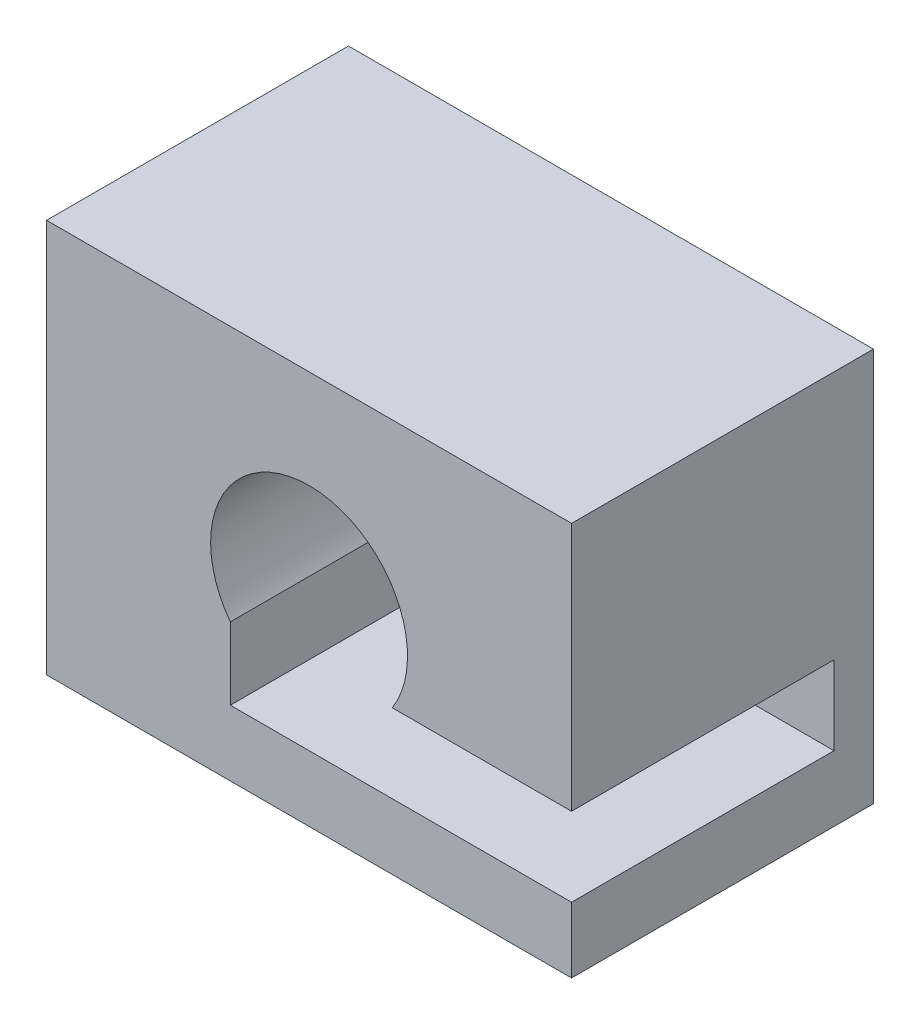
ISO-10303-21;
HEADER;
FILE_DESCRIPTION(('STEP AP214'),'2;1');
FILE_NAME('part.step','',(''),(''),'','','');
FILE_SCHEMA(('AUTOMOTIVE_DESIGN { 1 0 10303 214 1 1 1 1 }'));
ENDSEC;
DATA;
#1=APPLICATION_CONTEXT('core data for automotive mechanical design processes');
#2=APPLICATION_PROTOCOL_DEFINITION('international standard','automotive_design',2000,#1);
#3=PRODUCT_CONTEXT('',#1,'mechanical');
#4=PRODUCT('Part','Part','',(#3));
#5=PRODUCT_RELATED_PRODUCT_CATEGORY('part','',(#4));
#6=PRODUCT_DEFINITION_FORMATION('','',#4);
#7=PRODUCT_DEFINITION_CONTEXT('part definition',#1,'design');
#8=PRODUCT_DEFINITION('design','',#6,#7);
#9=PRODUCT_DEFINITION_SHAPE('','',#8);
#10=(LENGTH_UNIT() NAMED_UNIT(*) SI_UNIT(.MILLI.,.METRE.));
#11=(NAMED_UNIT(*) PLANE_ANGLE_UNIT() SI_UNIT($,.RADIAN.));
#12=(NAMED_UNIT(*) SI_UNIT($,.STERADIAN.) SOLID_ANGLE_UNIT());
#13=UNCERTAINTY_MEASURE_WITH_UNIT(LENGTH_MEASURE(1.E-05),#10,'distance_accuracy_value','');
#14=(GEOMETRIC_REPRESENTATION_CONTEXT(3) GLOBAL_UNCERTAINTY_ASSIGNED_CONTEXT((#13)) GLOBAL_UNIT_ASSIGNED_CONTEXT((#10,
#11,#12)) REPRESENTATION_CONTEXT('',''));
#15=CARTESIAN_POINT('',(0.,0.,0.));
#16=DIRECTION('',(0.,0.,1.));
#17=DIRECTION('',(1.,0.,0.));
#18=AXIS2_PLACEMENT_3D('',#15,#16,#17);
#19=CARTESIAN_POINT('',(20.,15.,23.));
#20=DIRECTION('',(1.,0.,0.));
#21=DIRECTION('',(0.,1.,0.));
#22=AXIS2_PLACEMENT_3D('',#19,#20,#21);
#23=PLANE('',#22);
#24=DIRECTION('',(0.,-1.,0.));
#25=VECTOR('',#24,1.);
#26=CARTESIAN_POINT('',(20.,15.,23.));
#27=LINE('',#26,#25);
#28=CARTESIAN_POINT('',(20.,15.,23.));
#29=VERTEX_POINT('',#28);
#30=CARTESIAN_POINT('',(20.,-4.,23.));
#31=VERTEX_POINT('',#30);
#32=EDGE_CURVE('E168',#29,#31,#27,.T.);
#33=ORIENTED_EDGE('',*,*,#32,.T.);
#34=DIRECTION('',(0.,0.,1.));
#35=VECTOR('',#34,1.);
#36=CARTESIAN_POINT('',(20.,-4.,3.));
#37=LINE('',#36,#35);
#38=CARTESIAN_POINT('',(20.,-4.,3.));
#39=VERTEX_POINT('',#38);
#40=EDGE_CURVE('E154',#39,#31,#37,.T.);
#41=ORIENTED_EDGE('',*,*,#40,.F.);
#42=DIRECTION('',(0.,1.,0.));
#43=VECTOR('',#42,1.);
#44=CARTESIAN_POINT('',(20.,0.,3.));
#45=LINE('',#44,#43);
#46=CARTESIAN_POINT('',(20.,-10.,3.));
#47=VERTEX_POINT('',#46);
#48=EDGE_CURVE('E142',#47,#39,#45,.T.);
#49=ORIENTED_EDGE('',*,*,#48,.F.);
#50=DIRECTION('',(0.,0.,1.));
#51=VECTOR('',#50,1.);
#52=CARTESIAN_POINT('',(20.,-10.,3.));
#53=LINE('',#52,#51);
#54=CARTESIAN_POINT('',(20.,-10.,23.));
#55=VERTEX_POINT('',#54);
#56=EDGE_CURVE('E156',#47,#55,#53,.T.);
#57=ORIENTED_EDGE('',*,*,#56,.T.);
#58=CARTESIAN_POINT('',(20.,-15.,23.));
#59=VERTEX_POINT('',#58);
#60=EDGE_CURVE('E167',#55,#59,#27,.T.);
#61=ORIENTED_EDGE('',*,*,#60,.T.);
#62=DIRECTION('',(0.,0.,-1.));
#63=VECTOR('',#62,1.);
#64=CARTESIAN_POINT('',(20.,-15.,23.));
#65=LINE('',#64,#63);
#66=CARTESIAN_POINT('',(20.,-15.,0.));
#67=VERTEX_POINT('',#66);
#68=EDGE_CURVE('E41',#59,#67,#65,.T.);
#69=ORIENTED_EDGE('',*,*,#68,.T.);
#70=DIRECTION('',(0.,-1.,0.));
#71=VECTOR('',#70,1.);
#72=CARTESIAN_POINT('',(20.,15.,0.));
#73=LINE('',#72,#71);
#74=CARTESIAN_POINT('',(20.,15.,0.));
#75=VERTEX_POINT('',#74);
#76=EDGE_CURVE('E177',#75,#67,#73,.T.);
#77=ORIENTED_EDGE('',*,*,#76,.F.);
#78=DIRECTION('',(0.,0.,-1.));
#79=VECTOR('',#78,1.);
#80=CARTESIAN_POINT('',(20.,15.,23.));
#81=LINE('',#80,#79);
#82=EDGE_CURVE('E183',#29,#75,#81,.T.);
#83=ORIENTED_EDGE('',*,*,#82,.F.);
#84=EDGE_LOOP('',(#33,#41,#49,#57,#61,#69,#77,#83));
#85=FACE_BOUND('',#84,.T.);
#86=ADVANCED_FACE('F33',(#85),#23,.T.);
#87=CARTESIAN_POINT('',(0.,0.,23.));
#88=DIRECTION('',(0.,0.,1.));
#89=DIRECTION('',(1.,0.,0.));
#90=AXIS2_PLACEMENT_3D('',#87,#88,#89);
#91=PLANE('',#90);
#92=CARTESIAN_POINT('',(0.,0.,23.));
#93=DIRECTION('',(0.,0.,1.));
#94=DIRECTION('',(1.,0.,0.));
#95=AXIS2_PLACEMENT_3D('',#92,#93,#94);
#96=CIRCLE('',#95,7.5);
#97=CARTESIAN_POINT('',(6.34428877022476,-4.,23.));
#98=VERTEX_POINT('',#97);
#99=CARTESIAN_POINT('',(-6.,-4.5,23.));
#100=VERTEX_POINT('',#99);
#101=EDGE_CURVE('E48',#98,#100,#96,.T.);
#102=ORIENTED_EDGE('',*,*,#101,.F.);
#103=DIRECTION('',(1.,0.,0.));
#104=VECTOR('',#103,1.);
#105=CARTESIAN_POINT('',(0.,-4.,23.));
#106=LINE('',#105,#104);
#107=EDGE_CURVE('E135',#98,#31,#106,.T.);
#108=ORIENTED_EDGE('',*,*,#107,.T.);
#109=ORIENTED_EDGE('',*,*,#32,.F.);
#110=DIRECTION('',(1.,0.,0.));
#111=VECTOR('',#110,1.);
#112=CARTESIAN_POINT('',(-20.,15.,23.));
#113=LINE('',#112,#111);
#114=CARTESIAN_POINT('',(-20.,15.,23.));
#115=VERTEX_POINT('',#114);
#116=EDGE_CURVE('E171',#115,#29,#113,.T.);
#117=ORIENTED_EDGE('',*,*,#116,.F.);
#118=DIRECTION('',(0.,-1.,0.));
#119=VECTOR('',#118,1.);
#120=CARTESIAN_POINT('',(-20.,15.,23.));
#121=LINE('',#120,#119);
#122=CARTESIAN_POINT('',(-20.,-15.,23.));
#123=VERTEX_POINT('',#122);
#124=EDGE_CURVE('E163',#115,#123,#121,.T.);
#125=ORIENTED_EDGE('',*,*,#124,.T.);
#126=DIRECTION('',(1.,0.,0.));
#127=VECTOR('',#126,1.);
#128=CARTESIAN_POINT('',(-20.,-15.,23.));
#129=LINE('',#128,#127);
#130=EDGE_CURVE('E83',#123,#59,#129,.T.);
#131=ORIENTED_EDGE('',*,*,#130,.T.);
#132=ORIENTED_EDGE('',*,*,#60,.F.);
#133=DIRECTION('',(1.,0.,0.));
#134=VECTOR('',#133,1.);
#135=CARTESIAN_POINT('',(0.,-10.,23.));
#136=LINE('',#135,#134);
#137=CARTESIAN_POINT('',(-6.,-10.,23.));
#138=VERTEX_POINT('',#137);
#139=EDGE_CURVE('E138',#138,#55,#136,.T.);
#140=ORIENTED_EDGE('',*,*,#139,.F.);
#141=DIRECTION('',(0.,-1.,0.));
#142=VECTOR('',#141,1.);
#143=CARTESIAN_POINT('',(-6.,0.,23.));
#144=LINE('',#143,#142);
#145=EDGE_CURVE('E148',#100,#138,#144,.T.);
#146=ORIENTED_EDGE('',*,*,#145,.F.);
#147=EDGE_LOOP('',(#102,#108,#109,#117,#125,#131,#132,#140,#146));
#148=FACE_BOUND('',#147,.T.);
#149=ADVANCED_FACE('F196',(#148),#91,.T.);
#150=CARTESIAN_POINT('',(0.,0.,0.));
#151=DIRECTION('',(0.,0.,1.));
#152=DIRECTION('',(1.,0.,0.));
#153=AXIS2_PLACEMENT_3D('',#150,#151,#152);
#154=CYLINDRICAL_SURFACE('',#153,6.1);
#155=CARTESIAN_POINT('',(0.,0.,0.));
#156=DIRECTION('',(0.,0.,1.));
#157=DIRECTION('',(1.,0.,0.));
#158=AXIS2_PLACEMENT_3D('',#155,#156,#157);
#159=CIRCLE('',#158,6.1);
#160=CARTESIAN_POINT('',(6.1,0.,0.));
#161=VERTEX_POINT('',#160);
#162=EDGE_CURVE('E153',#161,#161,#159,.T.);
#163=ORIENTED_EDGE('',*,*,#162,.F.);
#164=EDGE_LOOP('',(#163));
#165=FACE_BOUND('',#164,.T.);
#166=CARTESIAN_POINT('',(0.,0.,3.));
#167=DIRECTION('',(0.,0.,1.));
#168=DIRECTION('',(1.,0.,0.));
#169=AXIS2_PLACEMENT_3D('',#166,#167,#168);
#170=CIRCLE('',#169,6.1);
#171=CARTESIAN_POINT('',(6.1,0.,3.));
#172=VERTEX_POINT('',#171);
#173=EDGE_CURVE('E120',#172,#172,#170,.F.);
#174=ORIENTED_EDGE('',*,*,#173,.F.);
#175=EDGE_LOOP('',(#174));
#176=FACE_BOUND('',#175,.T.);
#177=ADVANCED_FACE('F205',(#165,#176),#154,.F.);
#178=CARTESIAN_POINT('',(-20.,15.,23.));
#179=DIRECTION('',(1.,0.,0.));
#180=DIRECTION('',(0.,0.,-1.));
#181=AXIS2_PLACEMENT_3D('',#178,#179,#180);
#182=PLANE('',#181);
#183=DIRECTION('',(0.,-1.,0.));
#184=VECTOR('',#183,1.);
#185=CARTESIAN_POINT('',(-20.,15.,0.));
#186=LINE('',#185,#184);
#187=CARTESIAN_POINT('',(-20.,15.,0.));
#188=VERTEX_POINT('',#187);
#189=CARTESIAN_POINT('',(-20.,-15.,0.));
#190=VERTEX_POINT('',#189);
#191=EDGE_CURVE('E162',#188,#190,#186,.T.);
#192=ORIENTED_EDGE('',*,*,#191,.T.);
#193=DIRECTION('',(0.,0.,-1.));
#194=VECTOR('',#193,1.);
#195=CARTESIAN_POINT('',(-20.,-15.,23.));
#196=LINE('',#195,#194);
#197=EDGE_CURVE('E11',#123,#190,#196,.T.);
#198=ORIENTED_EDGE('',*,*,#197,.F.);
#199=ORIENTED_EDGE('',*,*,#124,.F.);
#200=DIRECTION('',(0.,0.,-1.));
#201=VECTOR('',#200,1.);
#202=CARTESIAN_POINT('',(-20.,15.,23.));
#203=LINE('',#202,#201);
#204=EDGE_CURVE('E57',#115,#188,#203,.T.);
#205=ORIENTED_EDGE('',*,*,#204,.T.);
#206=EDGE_LOOP('',(#192,#198,#199,#205));
#207=FACE_BOUND('',#206,.T.);
#208=ADVANCED_FACE('F35',(#207),#182,.F.);
#209=CARTESIAN_POINT('',(-20.,-15.,23.));
#210=DIRECTION('',(0.,1.,0.));
#211=DIRECTION('',(-1.,0.,0.));
#212=AXIS2_PLACEMENT_3D('',#209,#210,#211);
#213=PLANE('',#212);
#214=DIRECTION('',(1.,0.,0.));
#215=VECTOR('',#214,1.);
#216=CARTESIAN_POINT('',(-20.,-15.,0.));
#217=LINE('',#216,#215);
#218=EDGE_CURVE('E174',#190,#67,#217,.T.);
#219=ORIENTED_EDGE('',*,*,#218,.T.);
#220=ORIENTED_EDGE('',*,*,#68,.F.);
#221=ORIENTED_EDGE('',*,*,#130,.F.);
#222=ORIENTED_EDGE('',*,*,#197,.T.);
#223=EDGE_LOOP('',(#219,#220,#221,#222));
#224=FACE_BOUND('',#223,.T.);
#225=ADVANCED_FACE('F187',(#224),#213,.F.);
#226=CARTESIAN_POINT('',(-20.,15.,23.));
#227=DIRECTION('',(0.,1.,0.));
#228=DIRECTION('',(0.,0.,1.));
#229=AXIS2_PLACEMENT_3D('',#226,#227,#228);
#230=PLANE('',#229);
#231=DIRECTION('',(1.,0.,0.));
#232=VECTOR('',#231,1.);
#233=CARTESIAN_POINT('',(-20.,15.,0.));
#234=LINE('',#233,#232);
#235=EDGE_CURVE('E165',#188,#75,#234,.T.);
#236=ORIENTED_EDGE('',*,*,#235,.F.);
#237=ORIENTED_EDGE('',*,*,#204,.F.);
#238=ORIENTED_EDGE('',*,*,#116,.T.);
#239=ORIENTED_EDGE('',*,*,#82,.T.);
#240=EDGE_LOOP('',(#236,#237,#238,#239));
#241=FACE_BOUND('',#240,.T.);
#242=ADVANCED_FACE('F191',(#241),#230,.T.);
#243=CARTESIAN_POINT('',(0.,0.,0.));
#244=DIRECTION('',(0.,0.,1.));
#245=DIRECTION('',(1.,0.,0.));
#246=AXIS2_PLACEMENT_3D('',#243,#244,#245);
#247=PLANE('',#246);
#248=ORIENTED_EDGE('',*,*,#162,.T.);
#249=EDGE_LOOP('',(#248));
#250=FACE_BOUND('',#249,.T.);
#251=ORIENTED_EDGE('',*,*,#191,.F.);
#252=ORIENTED_EDGE('',*,*,#235,.T.);
#253=ORIENTED_EDGE('',*,*,#76,.T.);
#254=ORIENTED_EDGE('',*,*,#218,.F.);
#255=EDGE_LOOP('',(#251,#252,#253,#254));
#256=FACE_BOUND('',#255,.T.);
#257=ADVANCED_FACE('F190',(#250,#256),#247,.F.);
#258=CARTESIAN_POINT('',(0.,0.,3.));
#259=DIRECTION('',(0.,0.,1.));
#260=DIRECTION('',(1.,0.,0.));
#261=AXIS2_PLACEMENT_3D('',#258,#259,#260);
#262=CYLINDRICAL_SURFACE('',#261,7.5);
#263=ORIENTED_EDGE('',*,*,#101,.T.);
#264=DIRECTION('',(0.,0.,1.));
#265=VECTOR('',#264,1.);
#266=CARTESIAN_POINT('',(-6.,-4.5,3.));
#267=LINE('',#266,#265);
#268=CARTESIAN_POINT('',(-6.,-4.5,3.));
#269=VERTEX_POINT('',#268);
#270=EDGE_CURVE('E111',#269,#100,#267,.T.);
#271=ORIENTED_EDGE('',*,*,#270,.F.);
#272=CARTESIAN_POINT('',(0.,0.,3.));
#273=DIRECTION('',(0.,0.,1.));
#274=DIRECTION('',(1.,0.,0.));
#275=AXIS2_PLACEMENT_3D('',#272,#273,#274);
#276=CIRCLE('',#275,7.5);
#277=CARTESIAN_POINT('',(6.34428877022476,-4.,3.));
#278=VERTEX_POINT('',#277);
#279=EDGE_CURVE('E115',#278,#269,#276,.T.);
#280=ORIENTED_EDGE('',*,*,#279,.F.);
#281=DIRECTION('',(0.,0.,1.));
#282=VECTOR('',#281,1.);
#283=CARTESIAN_POINT('',(6.34428877022476,-4.,3.));
#284=LINE('',#283,#282);
#285=EDGE_CURVE('E151',#278,#98,#284,.T.);
#286=ORIENTED_EDGE('',*,*,#285,.T.);
#287=EDGE_LOOP('',(#263,#271,#280,#286));
#288=FACE_BOUND('',#287,.T.);
#289=ADVANCED_FACE('F113',(#288),#262,.F.);
#290=CARTESIAN_POINT('',(0.,-4.,3.));
#291=DIRECTION('',(0.,-1.,0.));
#292=DIRECTION('',(0.,0.,-1.));
#293=AXIS2_PLACEMENT_3D('',#290,#291,#292);
#294=PLANE('',#293);
#295=ORIENTED_EDGE('',*,*,#107,.F.);
#296=ORIENTED_EDGE('',*,*,#285,.F.);
#297=DIRECTION('',(1.,0.,0.));
#298=VECTOR('',#297,1.);
#299=CARTESIAN_POINT('',(0.,-4.,3.));
#300=LINE('',#299,#298);
#301=EDGE_CURVE('E134',#278,#39,#300,.T.);
#302=ORIENTED_EDGE('',*,*,#301,.T.);
#303=ORIENTED_EDGE('',*,*,#40,.T.);
#304=EDGE_LOOP('',(#295,#296,#302,#303));
#305=FACE_BOUND('',#304,.T.);
#306=ADVANCED_FACE('F199',(#305),#294,.T.);
#307=CARTESIAN_POINT('',(0.,-10.,3.));
#308=DIRECTION('',(0.,-1.,0.));
#309=DIRECTION('',(1.,0.,0.));
#310=AXIS2_PLACEMENT_3D('',#307,#308,#309);
#311=PLANE('',#310);
#312=ORIENTED_EDGE('',*,*,#139,.T.);
#313=ORIENTED_EDGE('',*,*,#56,.F.);
#314=DIRECTION('',(1.,0.,0.));
#315=VECTOR('',#314,1.);
#316=CARTESIAN_POINT('',(0.,-10.,3.));
#317=LINE('',#316,#315);
#318=CARTESIAN_POINT('',(-6.,-10.,3.));
#319=VERTEX_POINT('',#318);
#320=EDGE_CURVE('E128',#319,#47,#317,.T.);
#321=ORIENTED_EDGE('',*,*,#320,.F.);
#322=DIRECTION('',(0.,0.,1.));
#323=VECTOR('',#322,1.);
#324=CARTESIAN_POINT('',(-6.,-10.,3.));
#325=LINE('',#324,#323);
#326=EDGE_CURVE('E119',#319,#138,#325,.T.);
#327=ORIENTED_EDGE('',*,*,#326,.T.);
#328=EDGE_LOOP('',(#312,#313,#321,#327));
#329=FACE_BOUND('',#328,.T.);
#330=ADVANCED_FACE('F202',(#329),#311,.F.);
#331=CARTESIAN_POINT('',(-6.,0.,3.));
#332=DIRECTION('',(-1.,0.,0.));
#333=DIRECTION('',(0.,-1.,0.));
#334=AXIS2_PLACEMENT_3D('',#331,#332,#333);
#335=PLANE('',#334);
#336=ORIENTED_EDGE('',*,*,#145,.T.);
#337=ORIENTED_EDGE('',*,*,#326,.F.);
#338=DIRECTION('',(0.,-1.,0.));
#339=VECTOR('',#338,1.);
#340=CARTESIAN_POINT('',(-6.,0.,3.));
#341=LINE('',#340,#339);
#342=EDGE_CURVE('E123',#269,#319,#341,.T.);
#343=ORIENTED_EDGE('',*,*,#342,.F.);
#344=ORIENTED_EDGE('',*,*,#270,.T.);
#345=EDGE_LOOP('',(#336,#337,#343,#344));
#346=FACE_BOUND('',#345,.T.);
#347=ADVANCED_FACE('F124',(#346),#335,.F.);
#348=CARTESIAN_POINT('',(0.,0.,3.));
#349=DIRECTION('',(0.,0.,1.));
#350=DIRECTION('',(1.,0.,0.));
#351=AXIS2_PLACEMENT_3D('',#348,#349,#350);
#352=PLANE('',#351);
#353=ORIENTED_EDGE('',*,*,#279,.T.);
#354=ORIENTED_EDGE('',*,*,#342,.T.);
#355=ORIENTED_EDGE('',*,*,#320,.T.);
#356=ORIENTED_EDGE('',*,*,#48,.T.);
#357=ORIENTED_EDGE('',*,*,#301,.F.);
#358=EDGE_LOOP('',(#353,#354,#355,#356,#357));
#359=FACE_BOUND('',#358,.T.);
#360=ORIENTED_EDGE('',*,*,#173,.T.);
#361=EDGE_LOOP('',(#360));
#362=FACE_BOUND('',#361,.T.);
#363=ADVANCED_FACE('F131',(#359,#362),#352,.T.);
#364=CLOSED_SHELL('',(#86,#149,#177,#208,#225,#242,#257,#289,#306,#330,#347,#363));
#365=MANIFOLD_SOLID_BREP('B2',#364);
#366=ADVANCED_BREP_SHAPE_REPRESENTATION('',(#18,#365),#14);
#367=SHAPE_DEFINITION_REPRESENTATION(#9,#366);
ENDSEC;
END-ISO-10303-21;
